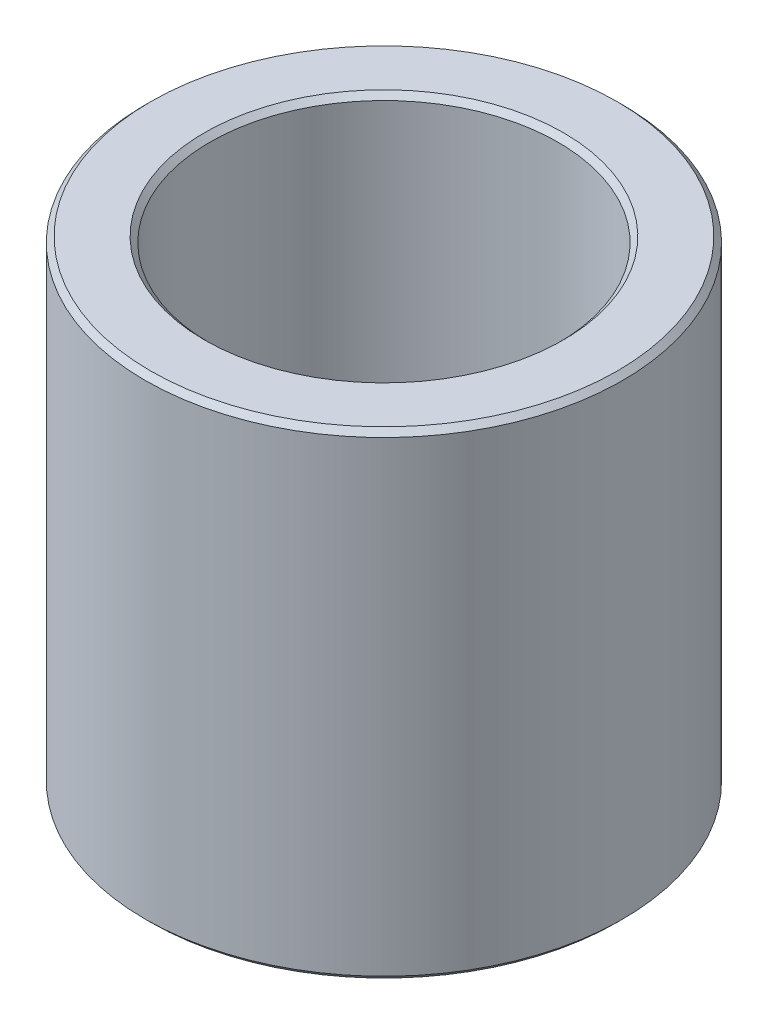
ISO-10303-21;
HEADER;
FILE_DESCRIPTION(('STEP AP214'),'2;1');
FILE_NAME('part.step','',(''),(''),'','','');
FILE_SCHEMA(('AUTOMOTIVE_DESIGN { 1 0 10303 214 1 1 1 1 }'));
ENDSEC;
DATA;
#1=APPLICATION_CONTEXT('core data for automotive mechanical design processes');
#2=APPLICATION_PROTOCOL_DEFINITION('international standard','automotive_design',2000,#1);
#3=PRODUCT_CONTEXT('',#1,'mechanical');
#4=PRODUCT('Part','Part','',(#3));
#5=PRODUCT_RELATED_PRODUCT_CATEGORY('part','',(#4));
#6=PRODUCT_DEFINITION_FORMATION('','',#4);
#7=PRODUCT_DEFINITION_CONTEXT('part definition',#1,'design');
#8=PRODUCT_DEFINITION('design','',#6,#7);
#9=PRODUCT_DEFINITION_SHAPE('','',#8);
#10=(LENGTH_UNIT() NAMED_UNIT(*) SI_UNIT(.MILLI.,.METRE.));
#11=(NAMED_UNIT(*) PLANE_ANGLE_UNIT() SI_UNIT($,.RADIAN.));
#12=(NAMED_UNIT(*) SI_UNIT($,.STERADIAN.) SOLID_ANGLE_UNIT());
#13=UNCERTAINTY_MEASURE_WITH_UNIT(LENGTH_MEASURE(1.E-05),#10,'distance_accuracy_value','');
#14=(GEOMETRIC_REPRESENTATION_CONTEXT(3) GLOBAL_UNCERTAINTY_ASSIGNED_CONTEXT((#13)) GLOBAL_UNIT_ASSIGNED_CONTEXT((#10,
#11,#12)) REPRESENTATION_CONTEXT('',''));
#15=CARTESIAN_POINT('',(0.,0.,0.));
#16=DIRECTION('',(0.,0.,1.));
#17=DIRECTION('',(1.,0.,0.));
#18=AXIS2_PLACEMENT_3D('',#15,#16,#17);
#19=CARTESIAN_POINT('',(0.,0.,0.));
#20=DIRECTION('',(0.,1.,0.));
#21=DIRECTION('',(1.,0.,0.));
#22=AXIS2_PLACEMENT_3D('',#19,#20,#21);
#23=PLANE('',#22);
#24=CARTESIAN_POINT('',(0.,0.,0.));
#25=DIRECTION('',(0.,1.,0.));
#26=DIRECTION('',(0.,0.,1.));
#27=AXIS2_PLACEMENT_3D('',#24,#25,#26);
#28=CIRCLE('',#27,4.1783);
#29=CARTESIAN_POINT('',(0.,0.,4.1783));
#30=VERTEX_POINT('',#29);
#31=EDGE_CURVE('E10',#30,#30,#28,.T.);
#32=ORIENTED_EDGE('',*,*,#31,.T.);
#33=EDGE_LOOP('',(#32));
#34=FACE_BOUND('',#33,.T.);
#35=CARTESIAN_POINT('',(0.,0.,0.));
#36=DIRECTION('',(0.,-1.,0.));
#37=DIRECTION('',(0.,0.,1.));
#38=AXIS2_PLACEMENT_3D('',#35,#36,#37);
#39=CIRCLE('',#38,5.42925);
#40=CARTESIAN_POINT('',(0.,0.,5.42925));
#41=VERTEX_POINT('',#40);
#42=EDGE_CURVE('E36',#41,#41,#39,.T.);
#43=ORIENTED_EDGE('',*,*,#42,.T.);
#44=EDGE_LOOP('',(#43));
#45=FACE_BOUND('',#44,.T.);
#46=ADVANCED_FACE('F14',(#34,#45),#23,.F.);
#47=CARTESIAN_POINT('',(0.,11.1125,0.));
#48=DIRECTION('',(0.,1.,0.));
#49=DIRECTION('',(1.,0.,0.));
#50=AXIS2_PLACEMENT_3D('',#47,#48,#49);
#51=PLANE('',#50);
#52=CARTESIAN_POINT('',(0.,11.1125,0.));
#53=DIRECTION('',(0.,-1.,0.));
#54=DIRECTION('',(0.,0.,1.));
#55=AXIS2_PLACEMENT_3D('',#52,#53,#54);
#56=CIRCLE('',#55,4.1783);
#57=CARTESIAN_POINT('',(0.,11.1125,4.1783));
#58=VERTEX_POINT('',#57);
#59=EDGE_CURVE('E43',#58,#58,#56,.T.);
#60=ORIENTED_EDGE('',*,*,#59,.T.);
#61=EDGE_LOOP('',(#60));
#62=FACE_BOUND('',#61,.T.);
#63=CARTESIAN_POINT('',(0.,11.1125,0.));
#64=DIRECTION('',(0.,1.,0.));
#65=DIRECTION('',(0.,0.,1.));
#66=AXIS2_PLACEMENT_3D('',#63,#64,#65);
#67=CIRCLE('',#66,5.42925);
#68=CARTESIAN_POINT('',(0.,11.1125,5.42925));
#69=VERTEX_POINT('',#68);
#70=EDGE_CURVE('E61',#69,#69,#67,.T.);
#71=ORIENTED_EDGE('',*,*,#70,.T.);
#72=EDGE_LOOP('',(#71));
#73=FACE_BOUND('',#72,.T.);
#74=ADVANCED_FACE('F72',(#62,#73),#51,.T.);
#75=CARTESIAN_POINT('',(0.,11.1125,0.));
#76=DIRECTION('',(0.,-1.,0.));
#77=DIRECTION('',(0.,0.,-1.));
#78=AXIS2_PLACEMENT_3D('',#75,#76,#77);
#79=CYLINDRICAL_SURFACE('',#78,5.55625);
#80=CARTESIAN_POINT('',(0.,0.126999999999997,0.));
#81=DIRECTION('',(0.,1.,0.));
#82=DIRECTION('',(0.,0.,1.));
#83=AXIS2_PLACEMENT_3D('',#80,#81,#82);
#84=CIRCLE('',#83,5.55625);
#85=CARTESIAN_POINT('',(0.,0.126999999999997,5.55625));
#86=VERTEX_POINT('',#85);
#87=EDGE_CURVE('E28',#86,#86,#84,.T.);
#88=ORIENTED_EDGE('',*,*,#87,.T.);
#89=EDGE_LOOP('',(#88));
#90=FACE_BOUND('',#89,.T.);
#91=CARTESIAN_POINT('',(0.,10.9855,0.));
#92=DIRECTION('',(0.,-1.,0.));
#93=DIRECTION('',(0.,0.,1.));
#94=AXIS2_PLACEMENT_3D('',#91,#92,#93);
#95=CIRCLE('',#94,5.55625);
#96=CARTESIAN_POINT('',(0.,10.9855,5.55625));
#97=VERTEX_POINT('',#96);
#98=EDGE_CURVE('E53',#97,#97,#95,.T.);
#99=ORIENTED_EDGE('',*,*,#98,.T.);
#100=EDGE_LOOP('',(#99));
#101=FACE_BOUND('',#100,.T.);
#102=ADVANCED_FACE('F91',(#90,#101),#79,.T.);
#103=CARTESIAN_POINT('',(0.,11.1125,0.));
#104=DIRECTION('',(0.,-1.,0.));
#105=DIRECTION('',(0.,0.,-1.));
#106=AXIS2_PLACEMENT_3D('',#103,#104,#105);
#107=CYLINDRICAL_SURFACE('',#106,4.0513);
#108=CARTESIAN_POINT('',(0.,0.127,0.));
#109=DIRECTION('',(0.,-1.,0.));
#110=DIRECTION('',(0.,0.,1.));
#111=AXIS2_PLACEMENT_3D('',#108,#109,#110);
#112=CIRCLE('',#111,4.0513);
#113=CARTESIAN_POINT('',(0.,0.127,4.0513));
#114=VERTEX_POINT('',#113);
#115=EDGE_CURVE('E21',#114,#114,#112,.T.);
#116=ORIENTED_EDGE('',*,*,#115,.T.);
#117=EDGE_LOOP('',(#116));
#118=FACE_BOUND('',#117,.T.);
#119=CARTESIAN_POINT('',(0.,10.9855,0.));
#120=DIRECTION('',(0.,1.,0.));
#121=DIRECTION('',(0.,0.,1.));
#122=AXIS2_PLACEMENT_3D('',#119,#120,#121);
#123=CIRCLE('',#122,4.0513);
#124=CARTESIAN_POINT('',(0.,10.9855,4.0513));
#125=VERTEX_POINT('',#124);
#126=EDGE_CURVE('E41',#125,#125,#123,.T.);
#127=ORIENTED_EDGE('',*,*,#126,.T.);
#128=EDGE_LOOP('',(#127));
#129=FACE_BOUND('',#128,.T.);
#130=ADVANCED_FACE('F103',(#118,#129),#107,.F.);
#131=CARTESIAN_POINT('',(0.,0.,0.));
#132=DIRECTION('',(0.,-1.,0.));
#133=DIRECTION('',(0.,0.,-1.));
#134=AXIS2_PLACEMENT_3D('',#131,#132,#133);
#135=CONICAL_SURFACE('',#134,4.1783,0.785398163397448);
#136=ORIENTED_EDGE('',*,*,#31,.F.);
#137=EDGE_LOOP('',(#136));
#138=FACE_BOUND('',#137,.T.);
#139=ORIENTED_EDGE('',*,*,#115,.F.);
#140=EDGE_LOOP('',(#139));
#141=FACE_BOUND('',#140,.T.);
#142=ADVANCED_FACE('F98',(#138,#141),#135,.F.);
#143=CARTESIAN_POINT('',(0.,0.126999999999997,0.));
#144=DIRECTION('',(0.,1.,0.));
#145=DIRECTION('',(0.,0.,1.));
#146=AXIS2_PLACEMENT_3D('',#143,#144,#145);
#147=CONICAL_SURFACE('',#146,5.55625,0.785398163397452);
#148=ORIENTED_EDGE('',*,*,#87,.F.);
#149=EDGE_LOOP('',(#148));
#150=FACE_BOUND('',#149,.T.);
#151=ORIENTED_EDGE('',*,*,#42,.F.);
#152=EDGE_LOOP('',(#151));
#153=FACE_BOUND('',#152,.T.);
#154=ADVANCED_FACE('F83',(#150,#153),#147,.T.);
#155=CARTESIAN_POINT('',(0.,10.9855,0.));
#156=DIRECTION('',(0.,1.,0.));
#157=DIRECTION('',(0.,0.,1.));
#158=AXIS2_PLACEMENT_3D('',#155,#156,#157);
#159=CONICAL_SURFACE('',#158,4.0513,0.785398163397442);
#160=ORIENTED_EDGE('',*,*,#59,.F.);
#161=EDGE_LOOP('',(#160));
#162=FACE_BOUND('',#161,.T.);
#163=ORIENTED_EDGE('',*,*,#126,.F.);
#164=EDGE_LOOP('',(#163));
#165=FACE_BOUND('',#164,.T.);
#166=ADVANCED_FACE('F77',(#162,#165),#159,.F.);
#167=CARTESIAN_POINT('',(0.,11.1125,0.));
#168=DIRECTION('',(0.,-1.,0.));
#169=DIRECTION('',(0.,0.,-1.));
#170=AXIS2_PLACEMENT_3D('',#167,#168,#169);
#171=CONICAL_SURFACE('',#170,5.42925,0.785398163397448);
#172=ORIENTED_EDGE('',*,*,#98,.F.);
#173=EDGE_LOOP('',(#172));
#174=FACE_BOUND('',#173,.T.);
#175=ORIENTED_EDGE('',*,*,#70,.F.);
#176=EDGE_LOOP('',(#175));
#177=FACE_BOUND('',#176,.T.);
#178=ADVANCED_FACE('F76',(#174,#177),#171,.T.);
#179=CLOSED_SHELL('',(#46,#74,#102,#130,#142,#154,#166,#178));
#180=MANIFOLD_SOLID_BREP('B1',#179);
#181=ADVANCED_BREP_SHAPE_REPRESENTATION('',(#18,#180),#14);
#182=SHAPE_DEFINITION_REPRESENTATION(#9,#181);
ENDSEC;
END-ISO-10303-21;
